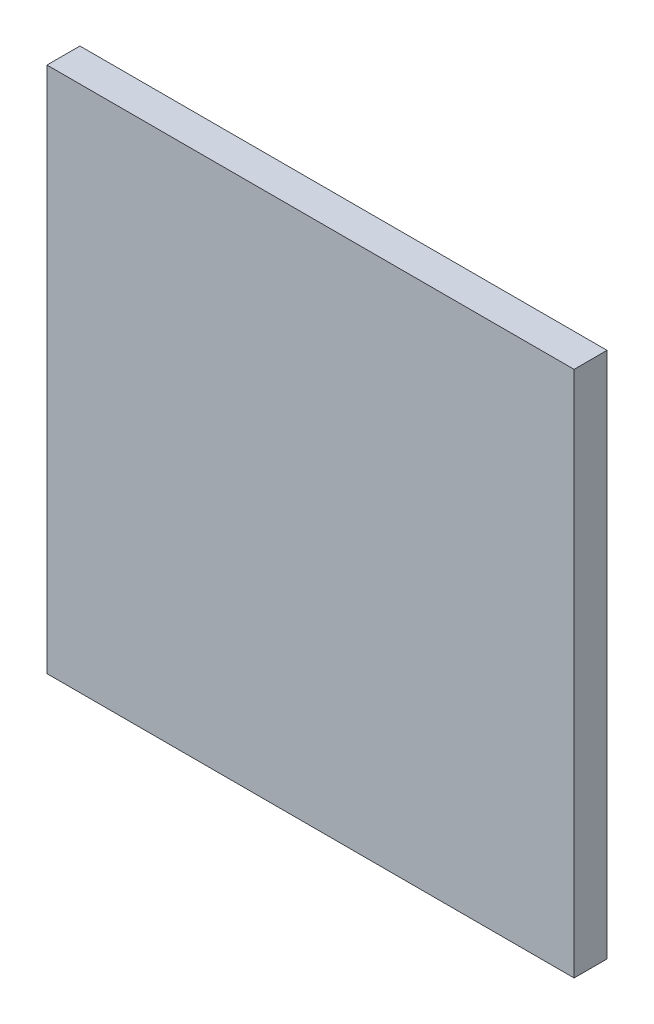
ISO-10303-21;
HEADER;
FILE_DESCRIPTION(('STEP AP214'),'2;1');
FILE_NAME('part.step','',(''),(''),'','','');
FILE_SCHEMA(('AUTOMOTIVE_DESIGN { 1 0 10303 214 1 1 1 1 }'));
ENDSEC;
DATA;
#1=APPLICATION_CONTEXT('core data for automotive mechanical design processes');
#2=APPLICATION_PROTOCOL_DEFINITION('international standard','automotive_design',2000,#1);
#3=PRODUCT_CONTEXT('',#1,'mechanical');
#4=PRODUCT('Part','Part','',(#3));
#5=PRODUCT_RELATED_PRODUCT_CATEGORY('part','',(#4));
#6=PRODUCT_DEFINITION_FORMATION('','',#4);
#7=PRODUCT_DEFINITION_CONTEXT('part definition',#1,'design');
#8=PRODUCT_DEFINITION('design','',#6,#7);
#9=PRODUCT_DEFINITION_SHAPE('','',#8);
#10=(LENGTH_UNIT() NAMED_UNIT(*) SI_UNIT(.MILLI.,.METRE.));
#11=(NAMED_UNIT(*) PLANE_ANGLE_UNIT() SI_UNIT($,.RADIAN.));
#12=(NAMED_UNIT(*) SI_UNIT($,.STERADIAN.) SOLID_ANGLE_UNIT());
#13=UNCERTAINTY_MEASURE_WITH_UNIT(LENGTH_MEASURE(1.E-05),#10,'distance_accuracy_value','');
#14=(GEOMETRIC_REPRESENTATION_CONTEXT(3) GLOBAL_UNCERTAINTY_ASSIGNED_CONTEXT((#13)) GLOBAL_UNIT_ASSIGNED_CONTEXT((#10,
#11,#12)) REPRESENTATION_CONTEXT('',''));
#15=CARTESIAN_POINT('',(0.,0.,0.));
#16=DIRECTION('',(0.,0.,1.));
#17=DIRECTION('',(1.,0.,0.));
#18=AXIS2_PLACEMENT_3D('',#15,#16,#17);
#19=CARTESIAN_POINT('',(0.,0.,2.5));
#20=DIRECTION('',(1.,0.,0.));
#21=DIRECTION('',(0.,0.,-1.));
#22=AXIS2_PLACEMENT_3D('',#19,#20,#21);
#23=PLANE('',#22);
#24=DIRECTION('',(0.,-1.,0.));
#25=VECTOR('',#24,1.);
#26=CARTESIAN_POINT('',(0.,0.,0.));
#27=LINE('',#26,#25);
#28=CARTESIAN_POINT('',(0.,40.,0.));
#29=VERTEX_POINT('',#28);
#30=CARTESIAN_POINT('',(0.,0.,0.));
#31=VERTEX_POINT('',#30);
#32=EDGE_CURVE('E96',#29,#31,#27,.T.);
#33=ORIENTED_EDGE('',*,*,#32,.T.);
#34=DIRECTION('',(0.,0.,-1.));
#35=VECTOR('',#34,1.);
#36=CARTESIAN_POINT('',(0.,0.,2.5));
#37=LINE('',#36,#35);
#38=CARTESIAN_POINT('',(0.,0.,2.5));
#39=VERTEX_POINT('',#38);
#40=EDGE_CURVE('E11',#39,#31,#37,.T.);
#41=ORIENTED_EDGE('',*,*,#40,.F.);
#42=DIRECTION('',(0.,-1.,0.));
#43=VECTOR('',#42,1.);
#44=CARTESIAN_POINT('',(0.,0.,2.5));
#45=LINE('',#44,#43);
#46=CARTESIAN_POINT('',(0.,40.,2.5));
#47=VERTEX_POINT('',#46);
#48=EDGE_CURVE('E84',#47,#39,#45,.T.);
#49=ORIENTED_EDGE('',*,*,#48,.F.);
#50=DIRECTION('',(0.,0.,-1.));
#51=VECTOR('',#50,1.);
#52=CARTESIAN_POINT('',(0.,40.,2.5));
#53=LINE('',#52,#51);
#54=EDGE_CURVE('E92',#47,#29,#53,.T.);
#55=ORIENTED_EDGE('',*,*,#54,.T.);
#56=EDGE_LOOP('',(#33,#41,#49,#55));
#57=FACE_BOUND('',#56,.T.);
#58=ADVANCED_FACE('F33',(#57),#23,.F.);
#59=CARTESIAN_POINT('',(0.,0.,2.5));
#60=DIRECTION('',(0.,1.,0.));
#61=DIRECTION('',(0.,0.,1.));
#62=AXIS2_PLACEMENT_3D('',#59,#60,#61);
#63=PLANE('',#62);
#64=DIRECTION('',(1.,0.,0.));
#65=VECTOR('',#64,1.);
#66=CARTESIAN_POINT('',(0.,0.,0.));
#67=LINE('',#66,#65);
#68=CARTESIAN_POINT('',(40.,0.,0.));
#69=VERTEX_POINT('',#68);
#70=EDGE_CURVE('E88',#31,#69,#67,.T.);
#71=ORIENTED_EDGE('',*,*,#70,.T.);
#72=DIRECTION('',(0.,0.,-1.));
#73=VECTOR('',#72,1.);
#74=CARTESIAN_POINT('',(40.,0.,2.5));
#75=LINE('',#74,#73);
#76=CARTESIAN_POINT('',(40.,0.,2.5));
#77=VERTEX_POINT('',#76);
#78=EDGE_CURVE('E41',#77,#69,#75,.T.);
#79=ORIENTED_EDGE('',*,*,#78,.F.);
#80=DIRECTION('',(1.,0.,0.));
#81=VECTOR('',#80,1.);
#82=CARTESIAN_POINT('',(0.,0.,2.5));
#83=LINE('',#82,#81);
#84=EDGE_CURVE('E79',#39,#77,#83,.T.);
#85=ORIENTED_EDGE('',*,*,#84,.F.);
#86=ORIENTED_EDGE('',*,*,#40,.T.);
#87=EDGE_LOOP('',(#71,#79,#85,#86));
#88=FACE_BOUND('',#87,.T.);
#89=ADVANCED_FACE('F87',(#88),#63,.F.);
#90=CARTESIAN_POINT('',(40.,0.,2.5));
#91=DIRECTION('',(-1.,0.,0.));
#92=DIRECTION('',(0.,-1.,0.));
#93=AXIS2_PLACEMENT_3D('',#90,#91,#92);
#94=PLANE('',#93);
#95=DIRECTION('',(0.,1.,0.));
#96=VECTOR('',#95,1.);
#97=CARTESIAN_POINT('',(40.,0.,0.));
#98=LINE('',#97,#96);
#99=CARTESIAN_POINT('',(40.,40.,0.));
#100=VERTEX_POINT('',#99);
#101=EDGE_CURVE('E66',#69,#100,#98,.T.);
#102=ORIENTED_EDGE('',*,*,#101,.T.);
#103=DIRECTION('',(0.,0.,-1.));
#104=VECTOR('',#103,1.);
#105=CARTESIAN_POINT('',(40.,40.,2.5));
#106=LINE('',#105,#104);
#107=CARTESIAN_POINT('',(40.,40.,2.5));
#108=VERTEX_POINT('',#107);
#109=EDGE_CURVE('E89',#108,#100,#106,.T.);
#110=ORIENTED_EDGE('',*,*,#109,.F.);
#111=DIRECTION('',(0.,1.,0.));
#112=VECTOR('',#111,1.);
#113=CARTESIAN_POINT('',(40.,0.,2.5));
#114=LINE('',#113,#112);
#115=EDGE_CURVE('E82',#77,#108,#114,.T.);
#116=ORIENTED_EDGE('',*,*,#115,.F.);
#117=ORIENTED_EDGE('',*,*,#78,.T.);
#118=EDGE_LOOP('',(#102,#110,#116,#117));
#119=FACE_BOUND('',#118,.T.);
#120=ADVANCED_FACE('F90',(#119),#94,.F.);
#121=CARTESIAN_POINT('',(0.,40.,2.5));
#122=DIRECTION('',(0.,-1.,0.));
#123=DIRECTION('',(0.,0.,-1.));
#124=AXIS2_PLACEMENT_3D('',#121,#122,#123);
#125=PLANE('',#124);
#126=DIRECTION('',(-1.,0.,0.));
#127=VECTOR('',#126,1.);
#128=CARTESIAN_POINT('',(0.,40.,0.));
#129=LINE('',#128,#127);
#130=EDGE_CURVE('E72',#100,#29,#129,.T.);
#131=ORIENTED_EDGE('',*,*,#130,.T.);
#132=ORIENTED_EDGE('',*,*,#54,.F.);
#133=DIRECTION('',(-1.,0.,0.));
#134=VECTOR('',#133,1.);
#135=CARTESIAN_POINT('',(0.,40.,2.5));
#136=LINE('',#135,#134);
#137=EDGE_CURVE('E49',#108,#47,#136,.T.);
#138=ORIENTED_EDGE('',*,*,#137,.F.);
#139=ORIENTED_EDGE('',*,*,#109,.T.);
#140=EDGE_LOOP('',(#131,#132,#138,#139));
#141=FACE_BOUND('',#140,.T.);
#142=ADVANCED_FACE('F103',(#141),#125,.F.);
#143=CARTESIAN_POINT('',(0.,0.,2.5));
#144=DIRECTION('',(0.,0.,-1.));
#145=DIRECTION('',(-1.,0.,0.));
#146=AXIS2_PLACEMENT_3D('',#143,#144,#145);
#147=PLANE('',#146);
#148=ORIENTED_EDGE('',*,*,#48,.T.);
#149=ORIENTED_EDGE('',*,*,#84,.T.);
#150=ORIENTED_EDGE('',*,*,#115,.T.);
#151=ORIENTED_EDGE('',*,*,#137,.T.);
#152=EDGE_LOOP('',(#148,#149,#150,#151));
#153=FACE_BOUND('',#152,.T.);
#154=ADVANCED_FACE('F80',(#153),#147,.F.);
#155=CARTESIAN_POINT('',(0.,0.,0.));
#156=DIRECTION('',(0.,0.,-1.));
#157=DIRECTION('',(-1.,0.,0.));
#158=AXIS2_PLACEMENT_3D('',#155,#156,#157);
#159=PLANE('',#158);
#160=ORIENTED_EDGE('',*,*,#32,.F.);
#161=ORIENTED_EDGE('',*,*,#130,.F.);
#162=ORIENTED_EDGE('',*,*,#101,.F.);
#163=ORIENTED_EDGE('',*,*,#70,.F.);
#164=EDGE_LOOP('',(#160,#161,#162,#163));
#165=FACE_BOUND('',#164,.T.);
#166=ADVANCED_FACE('F106',(#165),#159,.T.);
#167=CLOSED_SHELL('',(#58,#89,#120,#142,#154,#166));
#168=MANIFOLD_SOLID_BREP('B2',#167);
#169=ADVANCED_BREP_SHAPE_REPRESENTATION('',(#18,#168),#14);
#170=SHAPE_DEFINITION_REPRESENTATION(#9,#169);
ENDSEC;
END-ISO-10303-21;
